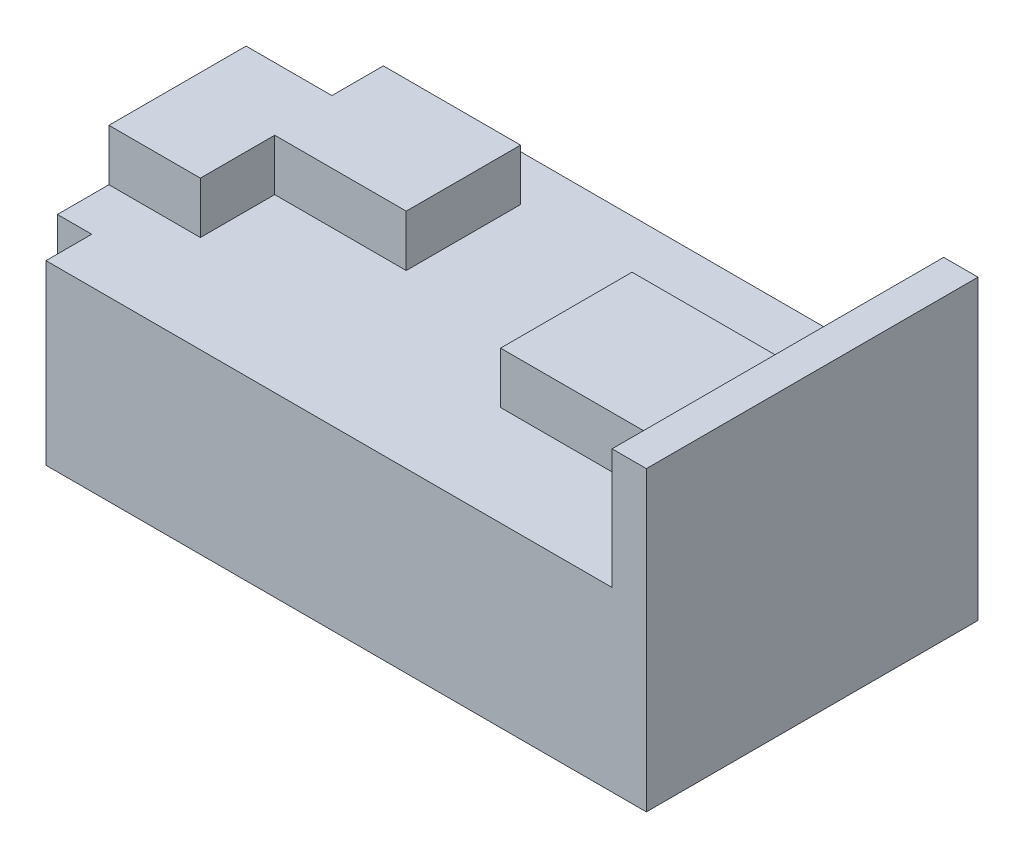
ISO-10303-21;
HEADER;
FILE_DESCRIPTION(('STEP AP214'),'2;1');
FILE_NAME('part.step','',(''),(''),'','','');
FILE_SCHEMA(('AUTOMOTIVE_DESIGN { 1 0 10303 214 1 1 1 1 }'));
ENDSEC;
DATA;
#1=APPLICATION_CONTEXT('core data for automotive mechanical design processes');
#2=APPLICATION_PROTOCOL_DEFINITION('international standard','automotive_design',2000,#1);
#3=PRODUCT_CONTEXT('',#1,'mechanical');
#4=PRODUCT('Part','Part','',(#3));
#5=PRODUCT_RELATED_PRODUCT_CATEGORY('part','',(#4));
#6=PRODUCT_DEFINITION_FORMATION('','',#4);
#7=PRODUCT_DEFINITION_CONTEXT('part definition',#1,'design');
#8=PRODUCT_DEFINITION('design','',#6,#7);
#9=PRODUCT_DEFINITION_SHAPE('','',#8);
#10=(LENGTH_UNIT() NAMED_UNIT(*) SI_UNIT(.MILLI.,.METRE.));
#11=(NAMED_UNIT(*) PLANE_ANGLE_UNIT() SI_UNIT($,.RADIAN.));
#12=(NAMED_UNIT(*) SI_UNIT($,.STERADIAN.) SOLID_ANGLE_UNIT());
#13=UNCERTAINTY_MEASURE_WITH_UNIT(LENGTH_MEASURE(1.E-05),#10,'distance_accuracy_value','');
#14=(GEOMETRIC_REPRESENTATION_CONTEXT(3) GLOBAL_UNCERTAINTY_ASSIGNED_CONTEXT((#13)) GLOBAL_UNIT_ASSIGNED_CONTEXT((#10,
#11,#12)) REPRESENTATION_CONTEXT('',''));
#15=CARTESIAN_POINT('',(0.,0.,0.));
#16=DIRECTION('',(0.,0.,1.));
#17=DIRECTION('',(1.,0.,0.));
#18=AXIS2_PLACEMENT_3D('',#15,#16,#17);
#19=CARTESIAN_POINT('',(-3.,15.5,29.));
#20=DIRECTION('',(0.,-1.,0.));
#21=DIRECTION('',(1.,0.,0.));
#22=AXIS2_PLACEMENT_3D('',#19,#20,#21);
#23=PLANE('',#22);
#24=DIRECTION('',(1.,0.,0.));
#25=VECTOR('',#24,1.);
#26=CARTESIAN_POINT('',(-55.5,15.5,20.5));
#27=LINE('',#26,#25);
#28=CARTESIAN_POINT('',(-55.5,15.5,20.5));
#29=VERTEX_POINT('',#28);
#30=CARTESIAN_POINT('',(-47.5,15.5,20.5));
#31=VERTEX_POINT('',#30);
#32=EDGE_CURVE('E350',#29,#31,#27,.T.);
#33=ORIENTED_EDGE('',*,*,#32,.F.);
#34=DIRECTION('',(0.,0.,-1.));
#35=VECTOR('',#34,1.);
#36=CARTESIAN_POINT('',(-55.5,15.5,29.));
#37=LINE('',#36,#35);
#38=CARTESIAN_POINT('',(-55.5,15.5,25.));
#39=VERTEX_POINT('',#38);
#40=EDGE_CURVE('E204',#39,#29,#37,.T.);
#41=ORIENTED_EDGE('',*,*,#40,.F.);
#42=DIRECTION('',(-1.,0.,0.));
#43=VECTOR('',#42,1.);
#44=CARTESIAN_POINT('',(-55.5,15.5,25.));
#45=LINE('',#44,#43);
#46=CARTESIAN_POINT('',(-52.5,15.5,25.));
#47=VERTEX_POINT('',#46);
#48=EDGE_CURVE('E264',#47,#39,#45,.T.);
#49=ORIENTED_EDGE('',*,*,#48,.F.);
#50=DIRECTION('',(0.,0.,-1.));
#51=VECTOR('',#50,1.);
#52=CARTESIAN_POINT('',(-52.5,15.5,29.));
#53=LINE('',#52,#51);
#54=CARTESIAN_POINT('',(-52.5,15.5,29.));
#55=VERTEX_POINT('',#54);
#56=EDGE_CURVE('E238',#55,#47,#53,.T.);
#57=ORIENTED_EDGE('',*,*,#56,.F.);
#58=DIRECTION('',(-1.,0.,0.));
#59=VECTOR('',#58,1.);
#60=CARTESIAN_POINT('',(-3.,15.5,29.));
#61=LINE('',#60,#59);
#62=CARTESIAN_POINT('',(-3.,15.5,29.));
#63=VERTEX_POINT('',#62);
#64=EDGE_CURVE('E278',#63,#55,#61,.T.);
#65=ORIENTED_EDGE('',*,*,#64,.F.);
#66=DIRECTION('',(0.,0.,-1.));
#67=VECTOR('',#66,1.);
#68=CARTESIAN_POINT('',(-3.,15.5,29.));
#69=LINE('',#68,#67);
#70=CARTESIAN_POINT('',(-3.,15.5,20.25));
#71=VERTEX_POINT('',#70);
#72=EDGE_CURVE('E11',#63,#71,#69,.T.);
#73=ORIENTED_EDGE('',*,*,#72,.T.);
#74=DIRECTION('',(1.,0.,0.));
#75=VECTOR('',#74,1.);
#76=CARTESIAN_POINT('',(-21.5,15.5,20.25));
#77=LINE('',#76,#75);
#78=CARTESIAN_POINT('',(-21.5,15.5,20.25));
#79=VERTEX_POINT('',#78);
#80=EDGE_CURVE('E208',#79,#71,#77,.T.);
#81=ORIENTED_EDGE('',*,*,#80,.F.);
#82=DIRECTION('',(0.,0.,1.));
#83=VECTOR('',#82,1.);
#84=CARTESIAN_POINT('',(-21.5,15.5,20.25));
#85=LINE('',#84,#83);
#86=CARTESIAN_POINT('',(-21.5,15.5,8.75));
#87=VERTEX_POINT('',#86);
#88=EDGE_CURVE('E205',#87,#79,#85,.T.);
#89=ORIENTED_EDGE('',*,*,#88,.F.);
#90=DIRECTION('',(-1.,0.,0.));
#91=VECTOR('',#90,1.);
#92=CARTESIAN_POINT('',(-21.5,15.5,8.75));
#93=LINE('',#92,#91);
#94=CARTESIAN_POINT('',(-3.,15.5,8.75000000000001));
#95=VERTEX_POINT('',#94);
#96=EDGE_CURVE('E218',#95,#87,#93,.T.);
#97=ORIENTED_EDGE('',*,*,#96,.F.);
#98=CARTESIAN_POINT('',(-3.,15.5,0.));
#99=VERTEX_POINT('',#98);
#100=EDGE_CURVE('E40',#95,#99,#69,.T.);
#101=ORIENTED_EDGE('',*,*,#100,.T.);
#102=DIRECTION('',(-1.,0.,0.));
#103=VECTOR('',#102,1.);
#104=CARTESIAN_POINT('',(-3.,15.5,0.));
#105=LINE('',#104,#103);
#106=CARTESIAN_POINT('',(-52.5,15.5,0.));
#107=VERTEX_POINT('',#106);
#108=EDGE_CURVE('E291',#99,#107,#105,.T.);
#109=ORIENTED_EDGE('',*,*,#108,.T.);
#110=DIRECTION('',(0.,0.,-1.));
#111=VECTOR('',#110,1.);
#112=CARTESIAN_POINT('',(-52.5,15.5,0.));
#113=LINE('',#112,#111);
#114=CARTESIAN_POINT('',(-52.5,15.5,4.));
#115=VERTEX_POINT('',#114);
#116=EDGE_CURVE('E243',#115,#107,#113,.T.);
#117=ORIENTED_EDGE('',*,*,#116,.F.);
#118=DIRECTION('',(1.,0.,0.));
#119=VECTOR('',#118,1.);
#120=CARTESIAN_POINT('',(-55.5,15.5,4.));
#121=LINE('',#120,#119);
#122=CARTESIAN_POINT('',(-55.5,15.5,4.));
#123=VERTEX_POINT('',#122);
#124=EDGE_CURVE('E247',#123,#115,#121,.T.);
#125=ORIENTED_EDGE('',*,*,#124,.F.);
#126=CARTESIAN_POINT('',(-55.5,15.5,8.50000000000001));
#127=VERTEX_POINT('',#126);
#128=EDGE_CURVE('E309',#127,#123,#37,.T.);
#129=ORIENTED_EDGE('',*,*,#128,.F.);
#130=DIRECTION('',(-1.,0.,0.));
#131=VECTOR('',#130,1.);
#132=CARTESIAN_POINT('',(-55.5,15.5,8.5));
#133=LINE('',#132,#131);
#134=CARTESIAN_POINT('',(-48.,15.5,8.5));
#135=VERTEX_POINT('',#134);
#136=EDGE_CURVE('E198',#135,#127,#133,.T.);
#137=ORIENTED_EDGE('',*,*,#136,.F.);
#138=DIRECTION('',(0.,0.,1.));
#139=VECTOR('',#138,1.);
#140=CARTESIAN_POINT('',(-48.,15.5,8.5));
#141=LINE('',#140,#139);
#142=CARTESIAN_POINT('',(-48.,15.5,4.));
#143=VERTEX_POINT('',#142);
#144=EDGE_CURVE('E364',#143,#135,#141,.T.);
#145=ORIENTED_EDGE('',*,*,#144,.F.);
#146=DIRECTION('',(-1.,0.,0.));
#147=VECTOR('',#146,1.);
#148=CARTESIAN_POINT('',(-48.,15.5,4.));
#149=LINE('',#148,#147);
#150=CARTESIAN_POINT('',(-36.,15.5,4.));
#151=VERTEX_POINT('',#150);
#152=EDGE_CURVE('E362',#151,#143,#149,.T.);
#153=ORIENTED_EDGE('',*,*,#152,.F.);
#154=DIRECTION('',(0.,0.,-1.));
#155=VECTOR('',#154,1.);
#156=CARTESIAN_POINT('',(-36.,15.5,14.));
#157=LINE('',#156,#155);
#158=CARTESIAN_POINT('',(-36.,15.5,14.));
#159=VERTEX_POINT('',#158);
#160=EDGE_CURVE('E360',#159,#151,#157,.T.);
#161=ORIENTED_EDGE('',*,*,#160,.F.);
#162=DIRECTION('',(1.,0.,0.));
#163=VECTOR('',#162,1.);
#164=CARTESIAN_POINT('',(-47.5,15.5,14.));
#165=LINE('',#164,#163);
#166=CARTESIAN_POINT('',(-47.5,15.5,14.));
#167=VERTEX_POINT('',#166);
#168=EDGE_CURVE('E354',#167,#159,#165,.T.);
#169=ORIENTED_EDGE('',*,*,#168,.F.);
#170=DIRECTION('',(0.,0.,-1.));
#171=VECTOR('',#170,1.);
#172=CARTESIAN_POINT('',(-47.5,15.5,20.5));
#173=LINE('',#172,#171);
#174=EDGE_CURVE('E352',#31,#167,#173,.T.);
#175=ORIENTED_EDGE('',*,*,#174,.F.);
#176=EDGE_LOOP('',(#33,#41,#49,#57,#65,#73,#81,#89,#97,#101,#109,#117,#125,#129,#137,#145,#153,
#161,#169,#175));
#177=FACE_BOUND('',#176,.T.);
#178=ADVANCED_FACE('F32',(#177),#23,.F.);
#179=CARTESIAN_POINT('',(-3.,26.,29.));
#180=DIRECTION('',(1.,0.,0.));
#181=DIRECTION('',(0.,1.,0.));
#182=AXIS2_PLACEMENT_3D('',#179,#180,#181);
#183=PLANE('',#182);
#184=DIRECTION('',(0.,-1.,0.));
#185=VECTOR('',#184,1.);
#186=CARTESIAN_POINT('',(-3.,20.,20.25));
#187=LINE('',#186,#185);
#188=CARTESIAN_POINT('',(-3.,20.,20.25));
#189=VERTEX_POINT('',#188);
#190=EDGE_CURVE('E233',#189,#71,#187,.T.);
#191=ORIENTED_EDGE('',*,*,#190,.T.);
#192=ORIENTED_EDGE('',*,*,#72,.F.);
#193=DIRECTION('',(0.,-1.,0.));
#194=VECTOR('',#193,1.);
#195=CARTESIAN_POINT('',(-3.,26.,29.));
#196=LINE('',#195,#194);
#197=CARTESIAN_POINT('',(-3.,26.,29.));
#198=VERTEX_POINT('',#197);
#199=EDGE_CURVE('E275',#198,#63,#196,.T.);
#200=ORIENTED_EDGE('',*,*,#199,.F.);
#201=DIRECTION('',(0.,0.,-1.));
#202=VECTOR('',#201,1.);
#203=CARTESIAN_POINT('',(-3.,26.,29.));
#204=LINE('',#203,#202);
#205=CARTESIAN_POINT('',(-3.,26.,0.));
#206=VERTEX_POINT('',#205);
#207=EDGE_CURVE('E288',#198,#206,#204,.T.);
#208=ORIENTED_EDGE('',*,*,#207,.T.);
#209=DIRECTION('',(0.,-1.,0.));
#210=VECTOR('',#209,1.);
#211=CARTESIAN_POINT('',(-3.,26.,0.));
#212=LINE('',#211,#210);
#213=EDGE_CURVE('E255',#206,#99,#212,.T.);
#214=ORIENTED_EDGE('',*,*,#213,.T.);
#215=ORIENTED_EDGE('',*,*,#100,.F.);
#216=DIRECTION('',(0.,-1.,0.));
#217=VECTOR('',#216,1.);
#218=CARTESIAN_POINT('',(-3.,20.,8.75));
#219=LINE('',#218,#217);
#220=CARTESIAN_POINT('',(-3.,20.,8.75));
#221=VERTEX_POINT('',#220);
#222=EDGE_CURVE('E55',#221,#95,#219,.T.);
#223=ORIENTED_EDGE('',*,*,#222,.F.);
#224=DIRECTION('',(0.,0.,-1.));
#225=VECTOR('',#224,1.);
#226=CARTESIAN_POINT('',(-3.,20.,20.25));
#227=LINE('',#226,#225);
#228=EDGE_CURVE('E221',#189,#221,#227,.T.);
#229=ORIENTED_EDGE('',*,*,#228,.F.);
#230=EDGE_LOOP('',(#191,#192,#200,#208,#214,#215,#223,#229));
#231=FACE_BOUND('',#230,.T.);
#232=ADVANCED_FACE('F34',(#231),#183,.F.);
#233=CARTESIAN_POINT('',(-55.5,15.5,29.));
#234=DIRECTION('',(1.,0.,0.));
#235=DIRECTION('',(0.,0.,-1.));
#236=AXIS2_PLACEMENT_3D('',#233,#234,#235);
#237=PLANE('',#236);
#238=ORIENTED_EDGE('',*,*,#40,.T.);
#239=DIRECTION('',(0.,-1.,0.));
#240=VECTOR('',#239,1.);
#241=CARTESIAN_POINT('',(-55.5,20.,20.5));
#242=LINE('',#241,#240);
#243=CARTESIAN_POINT('',(-55.5,20.,20.5));
#244=VERTEX_POINT('',#243);
#245=EDGE_CURVE('E186',#244,#29,#242,.T.);
#246=ORIENTED_EDGE('',*,*,#245,.F.);
#247=DIRECTION('',(0.,0.,1.));
#248=VECTOR('',#247,1.);
#249=CARTESIAN_POINT('',(-55.5,20.,20.5));
#250=LINE('',#249,#248);
#251=CARTESIAN_POINT('',(-55.5,20.,8.5));
#252=VERTEX_POINT('',#251);
#253=EDGE_CURVE('E193',#252,#244,#250,.T.);
#254=ORIENTED_EDGE('',*,*,#253,.F.);
#255=DIRECTION('',(0.,-1.,0.));
#256=VECTOR('',#255,1.);
#257=CARTESIAN_POINT('',(-55.5,20.,8.5));
#258=LINE('',#257,#256);
#259=EDGE_CURVE('E47',#252,#127,#258,.T.);
#260=ORIENTED_EDGE('',*,*,#259,.T.);
#261=ORIENTED_EDGE('',*,*,#128,.T.);
#262=DIRECTION('',(0.,1.,0.));
#263=VECTOR('',#262,1.);
#264=CARTESIAN_POINT('',(-55.5,0.,4.));
#265=LINE('',#264,#263);
#266=CARTESIAN_POINT('',(-55.5,0.,4.));
#267=VERTEX_POINT('',#266);
#268=EDGE_CURVE('E246',#267,#123,#265,.T.);
#269=ORIENTED_EDGE('',*,*,#268,.F.);
#270=DIRECTION('',(0.,0.,-1.));
#271=VECTOR('',#270,1.);
#272=CARTESIAN_POINT('',(-55.5,0.,29.));
#273=LINE('',#272,#271);
#274=CARTESIAN_POINT('',(-55.5,0.,25.));
#275=VERTEX_POINT('',#274);
#276=EDGE_CURVE('E307',#275,#267,#273,.T.);
#277=ORIENTED_EDGE('',*,*,#276,.F.);
#278=DIRECTION('',(0.,1.,0.));
#279=VECTOR('',#278,1.);
#280=CARTESIAN_POINT('',(-55.5,0.,25.));
#281=LINE('',#280,#279);
#282=EDGE_CURVE('E250',#275,#39,#281,.T.);
#283=ORIENTED_EDGE('',*,*,#282,.T.);
#284=EDGE_LOOP('',(#238,#246,#254,#260,#261,#269,#277,#283));
#285=FACE_BOUND('',#284,.T.);
#286=ADVANCED_FACE('F201',(#285),#237,.F.);
#287=CARTESIAN_POINT('',(-55.5,0.,29.));
#288=DIRECTION('',(0.,1.,0.));
#289=DIRECTION('',(0.,0.,1.));
#290=AXIS2_PLACEMENT_3D('',#287,#288,#289);
#291=PLANE('',#290);
#292=DIRECTION('',(1.,0.,0.));
#293=VECTOR('',#292,1.);
#294=CARTESIAN_POINT('',(-55.5,0.,4.));
#295=LINE('',#294,#293);
#296=CARTESIAN_POINT('',(-52.5,0.,4.));
#297=VERTEX_POINT('',#296);
#298=EDGE_CURVE('E239',#267,#297,#295,.T.);
#299=ORIENTED_EDGE('',*,*,#298,.T.);
#300=DIRECTION('',(0.,0.,-1.));
#301=VECTOR('',#300,1.);
#302=CARTESIAN_POINT('',(-52.5,0.,0.));
#303=LINE('',#302,#301);
#304=CARTESIAN_POINT('',(-52.5,0.,0.));
#305=VERTEX_POINT('',#304);
#306=EDGE_CURVE('E242',#297,#305,#303,.T.);
#307=ORIENTED_EDGE('',*,*,#306,.T.);
#308=DIRECTION('',(1.,0.,0.));
#309=VECTOR('',#308,1.);
#310=CARTESIAN_POINT('',(-55.5,0.,0.));
#311=LINE('',#310,#309);
#312=CARTESIAN_POINT('',(0.,0.,0.));
#313=VERTEX_POINT('',#312);
#314=EDGE_CURVE('E294',#305,#313,#311,.T.);
#315=ORIENTED_EDGE('',*,*,#314,.T.);
#316=DIRECTION('',(0.,0.,-1.));
#317=VECTOR('',#316,1.);
#318=CARTESIAN_POINT('',(0.,0.,29.));
#319=LINE('',#318,#317);
#320=CARTESIAN_POINT('',(0.,0.,29.));
#321=VERTEX_POINT('',#320);
#322=EDGE_CURVE('E304',#321,#313,#319,.T.);
#323=ORIENTED_EDGE('',*,*,#322,.F.);
#324=DIRECTION('',(1.,0.,0.));
#325=VECTOR('',#324,1.);
#326=CARTESIAN_POINT('',(-55.5,0.,29.));
#327=LINE('',#326,#325);
#328=CARTESIAN_POINT('',(-52.5,0.,29.));
#329=VERTEX_POINT('',#328);
#330=EDGE_CURVE('E282',#329,#321,#327,.T.);
#331=ORIENTED_EDGE('',*,*,#330,.F.);
#332=DIRECTION('',(0.,0.,-1.));
#333=VECTOR('',#332,1.);
#334=CARTESIAN_POINT('',(-52.5,0.,29.));
#335=LINE('',#334,#333);
#336=CARTESIAN_POINT('',(-52.5,0.,25.));
#337=VERTEX_POINT('',#336);
#338=EDGE_CURVE('E260',#329,#337,#335,.T.);
#339=ORIENTED_EDGE('',*,*,#338,.T.);
#340=DIRECTION('',(-1.,0.,0.));
#341=VECTOR('',#340,1.);
#342=CARTESIAN_POINT('',(-55.5,0.,25.));
#343=LINE('',#342,#341);
#344=EDGE_CURVE('E263',#337,#275,#343,.T.);
#345=ORIENTED_EDGE('',*,*,#344,.T.);
#346=ORIENTED_EDGE('',*,*,#276,.T.);
#347=EDGE_LOOP('',(#299,#307,#315,#323,#331,#339,#345,#346));
#348=FACE_BOUND('',#347,.T.);
#349=ADVANCED_FACE('F331',(#348),#291,.F.);
#350=CARTESIAN_POINT('',(0.,0.,29.));
#351=DIRECTION('',(-1.,0.,0.));
#352=DIRECTION('',(0.,0.,1.));
#353=AXIS2_PLACEMENT_3D('',#350,#351,#352);
#354=PLANE('',#353);
#355=DIRECTION('',(0.,1.,0.));
#356=VECTOR('',#355,1.);
#357=CARTESIAN_POINT('',(0.,0.,0.));
#358=LINE('',#357,#356);
#359=CARTESIAN_POINT('',(0.,26.,0.));
#360=VERTEX_POINT('',#359);
#361=EDGE_CURVE('E296',#313,#360,#358,.T.);
#362=ORIENTED_EDGE('',*,*,#361,.T.);
#363=DIRECTION('',(0.,0.,-1.));
#364=VECTOR('',#363,1.);
#365=CARTESIAN_POINT('',(0.,26.,29.));
#366=LINE('',#365,#364);
#367=CARTESIAN_POINT('',(0.,26.,29.));
#368=VERTEX_POINT('',#367);
#369=EDGE_CURVE('E301',#368,#360,#366,.T.);
#370=ORIENTED_EDGE('',*,*,#369,.F.);
#371=DIRECTION('',(0.,1.,0.));
#372=VECTOR('',#371,1.);
#373=CARTESIAN_POINT('',(0.,0.,29.));
#374=LINE('',#373,#372);
#375=EDGE_CURVE('E284',#321,#368,#374,.T.);
#376=ORIENTED_EDGE('',*,*,#375,.F.);
#377=ORIENTED_EDGE('',*,*,#322,.T.);
#378=EDGE_LOOP('',(#362,#370,#376,#377));
#379=FACE_BOUND('',#378,.T.);
#380=ADVANCED_FACE('F335',(#379),#354,.F.);
#381=CARTESIAN_POINT('',(0.,26.,29.));
#382=DIRECTION('',(0.,-1.,0.));
#383=DIRECTION('',(0.,0.,-1.));
#384=AXIS2_PLACEMENT_3D('',#381,#382,#383);
#385=PLANE('',#384);
#386=DIRECTION('',(-1.,0.,0.));
#387=VECTOR('',#386,1.);
#388=CARTESIAN_POINT('',(0.,26.,0.));
#389=LINE('',#388,#387);
#390=EDGE_CURVE('E279',#360,#206,#389,.T.);
#391=ORIENTED_EDGE('',*,*,#390,.T.);
#392=ORIENTED_EDGE('',*,*,#207,.F.);
#393=DIRECTION('',(-1.,0.,0.));
#394=VECTOR('',#393,1.);
#395=CARTESIAN_POINT('',(0.,26.,29.));
#396=LINE('',#395,#394);
#397=EDGE_CURVE('E286',#368,#198,#396,.T.);
#398=ORIENTED_EDGE('',*,*,#397,.F.);
#399=ORIENTED_EDGE('',*,*,#369,.T.);
#400=EDGE_LOOP('',(#391,#392,#398,#399));
#401=FACE_BOUND('',#400,.T.);
#402=ADVANCED_FACE('F427',(#401),#385,.F.);
#403=CARTESIAN_POINT('',(0.,0.,29.));
#404=DIRECTION('',(0.,0.,-1.));
#405=DIRECTION('',(-1.,0.,0.));
#406=AXIS2_PLACEMENT_3D('',#403,#404,#405);
#407=PLANE('',#406);
#408=ORIENTED_EDGE('',*,*,#64,.T.);
#409=DIRECTION('',(0.,1.,0.));
#410=VECTOR('',#409,1.);
#411=CARTESIAN_POINT('',(-52.5,0.,29.));
#412=LINE('',#411,#410);
#413=EDGE_CURVE('E267',#329,#55,#412,.T.);
#414=ORIENTED_EDGE('',*,*,#413,.F.);
#415=ORIENTED_EDGE('',*,*,#330,.T.);
#416=ORIENTED_EDGE('',*,*,#375,.T.);
#417=ORIENTED_EDGE('',*,*,#397,.T.);
#418=ORIENTED_EDGE('',*,*,#199,.T.);
#419=EDGE_LOOP('',(#408,#414,#415,#416,#417,#418));
#420=FACE_BOUND('',#419,.T.);
#421=ADVANCED_FACE('F339',(#420),#407,.F.);
#422=CARTESIAN_POINT('',(0.,0.,0.));
#423=DIRECTION('',(0.,0.,-1.));
#424=DIRECTION('',(-1.,0.,0.));
#425=AXIS2_PLACEMENT_3D('',#422,#423,#424);
#426=PLANE('',#425);
#427=DIRECTION('',(0.,1.,0.));
#428=VECTOR('',#427,1.);
#429=CARTESIAN_POINT('',(-52.5,0.,0.));
#430=LINE('',#429,#428);
#431=EDGE_CURVE('E252',#305,#107,#430,.T.);
#432=ORIENTED_EDGE('',*,*,#431,.T.);
#433=ORIENTED_EDGE('',*,*,#108,.F.);
#434=ORIENTED_EDGE('',*,*,#213,.F.);
#435=ORIENTED_EDGE('',*,*,#390,.F.);
#436=ORIENTED_EDGE('',*,*,#361,.F.);
#437=ORIENTED_EDGE('',*,*,#314,.F.);
#438=EDGE_LOOP('',(#432,#433,#434,#435,#436,#437));
#439=FACE_BOUND('',#438,.T.);
#440=ADVANCED_FACE('F325',(#439),#426,.T.);
#441=CARTESIAN_POINT('',(-52.5,0.,0.));
#442=DIRECTION('',(1.,0.,0.));
#443=DIRECTION('',(0.,1.,0.));
#444=AXIS2_PLACEMENT_3D('',#441,#442,#443);
#445=PLANE('',#444);
#446=ORIENTED_EDGE('',*,*,#116,.T.);
#447=ORIENTED_EDGE('',*,*,#431,.F.);
#448=ORIENTED_EDGE('',*,*,#306,.F.);
#449=DIRECTION('',(0.,1.,0.));
#450=VECTOR('',#449,1.);
#451=CARTESIAN_POINT('',(-52.5,0.,4.));
#452=LINE('',#451,#450);
#453=EDGE_CURVE('E256',#297,#115,#452,.T.);
#454=ORIENTED_EDGE('',*,*,#453,.T.);
#455=EDGE_LOOP('',(#446,#447,#448,#454));
#456=FACE_BOUND('',#455,.T.);
#457=ADVANCED_FACE('F321',(#456),#445,.F.);
#458=CARTESIAN_POINT('',(-55.5,0.,4.));
#459=DIRECTION('',(0.,0.,1.));
#460=DIRECTION('',(1.,0.,0.));
#461=AXIS2_PLACEMENT_3D('',#458,#459,#460);
#462=PLANE('',#461);
#463=ORIENTED_EDGE('',*,*,#124,.T.);
#464=ORIENTED_EDGE('',*,*,#453,.F.);
#465=ORIENTED_EDGE('',*,*,#298,.F.);
#466=ORIENTED_EDGE('',*,*,#268,.T.);
#467=EDGE_LOOP('',(#463,#464,#465,#466));
#468=FACE_BOUND('',#467,.T.);
#469=ADVANCED_FACE('F317',(#468),#462,.F.);
#470=CARTESIAN_POINT('',(-55.5,0.,25.));
#471=DIRECTION('',(0.,0.,-1.));
#472=DIRECTION('',(-1.,0.,0.));
#473=AXIS2_PLACEMENT_3D('',#470,#471,#472);
#474=PLANE('',#473);
#475=ORIENTED_EDGE('',*,*,#48,.T.);
#476=ORIENTED_EDGE('',*,*,#282,.F.);
#477=ORIENTED_EDGE('',*,*,#344,.F.);
#478=DIRECTION('',(0.,1.,0.));
#479=VECTOR('',#478,1.);
#480=CARTESIAN_POINT('',(-52.5,0.,25.));
#481=LINE('',#480,#479);
#482=EDGE_CURVE('E272',#337,#47,#481,.T.);
#483=ORIENTED_EDGE('',*,*,#482,.T.);
#484=EDGE_LOOP('',(#475,#476,#477,#483));
#485=FACE_BOUND('',#484,.T.);
#486=ADVANCED_FACE('F348',(#485),#474,.F.);
#487=CARTESIAN_POINT('',(-52.5,0.,29.));
#488=DIRECTION('',(1.,0.,0.));
#489=DIRECTION('',(0.,1.,0.));
#490=AXIS2_PLACEMENT_3D('',#487,#488,#489);
#491=PLANE('',#490);
#492=ORIENTED_EDGE('',*,*,#56,.T.);
#493=ORIENTED_EDGE('',*,*,#482,.F.);
#494=ORIENTED_EDGE('',*,*,#338,.F.);
#495=ORIENTED_EDGE('',*,*,#413,.T.);
#496=EDGE_LOOP('',(#492,#493,#494,#495));
#497=FACE_BOUND('',#496,.T.);
#498=ADVANCED_FACE('F344',(#497),#491,.F.);
#499=CARTESIAN_POINT('',(-21.5,20.,20.25));
#500=DIRECTION('',(1.,0.,0.));
#501=DIRECTION('',(0.,1.,0.));
#502=AXIS2_PLACEMENT_3D('',#499,#500,#501);
#503=PLANE('',#502);
#504=ORIENTED_EDGE('',*,*,#88,.T.);
#505=DIRECTION('',(0.,-1.,0.));
#506=VECTOR('',#505,1.);
#507=CARTESIAN_POINT('',(-21.5,20.,20.25));
#508=LINE('',#507,#506);
#509=CARTESIAN_POINT('',(-21.5,20.,20.25));
#510=VERTEX_POINT('',#509);
#511=EDGE_CURVE('E235',#510,#79,#508,.T.);
#512=ORIENTED_EDGE('',*,*,#511,.F.);
#513=DIRECTION('',(0.,0.,1.));
#514=VECTOR('',#513,1.);
#515=CARTESIAN_POINT('',(-21.5,20.,20.25));
#516=LINE('',#515,#514);
#517=CARTESIAN_POINT('',(-21.5,20.,8.75));
#518=VERTEX_POINT('',#517);
#519=EDGE_CURVE('E214',#518,#510,#516,.T.);
#520=ORIENTED_EDGE('',*,*,#519,.F.);
#521=DIRECTION('',(0.,-1.,0.));
#522=VECTOR('',#521,1.);
#523=CARTESIAN_POINT('',(-21.5,20.,8.75));
#524=LINE('',#523,#522);
#525=EDGE_CURVE('E224',#518,#87,#524,.T.);
#526=ORIENTED_EDGE('',*,*,#525,.T.);
#527=EDGE_LOOP('',(#504,#512,#520,#526));
#528=FACE_BOUND('',#527,.T.);
#529=ADVANCED_FACE('F437',(#528),#503,.F.);
#530=CARTESIAN_POINT('',(-21.5,20.,20.25));
#531=DIRECTION('',(0.,0.,-1.));
#532=DIRECTION('',(-1.,0.,0.));
#533=AXIS2_PLACEMENT_3D('',#530,#531,#532);
#534=PLANE('',#533);
#535=ORIENTED_EDGE('',*,*,#80,.T.);
#536=ORIENTED_EDGE('',*,*,#190,.F.);
#537=DIRECTION('',(1.,0.,0.));
#538=VECTOR('',#537,1.);
#539=CARTESIAN_POINT('',(-21.5,20.,20.25));
#540=LINE('',#539,#538);
#541=EDGE_CURVE('E217',#510,#189,#540,.T.);
#542=ORIENTED_EDGE('',*,*,#541,.F.);
#543=ORIENTED_EDGE('',*,*,#511,.T.);
#544=EDGE_LOOP('',(#535,#536,#542,#543));
#545=FACE_BOUND('',#544,.T.);
#546=ADVANCED_FACE('F446',(#545),#534,.F.);
#547=CARTESIAN_POINT('',(-21.5,20.,8.75));
#548=DIRECTION('',(0.,0.,1.));
#549=DIRECTION('',(1.,0.,0.));
#550=AXIS2_PLACEMENT_3D('',#547,#548,#549);
#551=PLANE('',#550);
#552=ORIENTED_EDGE('',*,*,#96,.T.);
#553=ORIENTED_EDGE('',*,*,#525,.F.);
#554=DIRECTION('',(-1.,0.,0.));
#555=VECTOR('',#554,1.);
#556=CARTESIAN_POINT('',(-21.5,20.,8.75));
#557=LINE('',#556,#555);
#558=EDGE_CURVE('E223',#221,#518,#557,.T.);
#559=ORIENTED_EDGE('',*,*,#558,.F.);
#560=ORIENTED_EDGE('',*,*,#222,.T.);
#561=EDGE_LOOP('',(#552,#553,#559,#560));
#562=FACE_BOUND('',#561,.T.);
#563=ADVANCED_FACE('F450',(#562),#551,.F.);
#564=CARTESIAN_POINT('',(0.,20.,0.));
#565=DIRECTION('',(0.,-1.,0.));
#566=DIRECTION('',(1.,0.,0.));
#567=AXIS2_PLACEMENT_3D('',#564,#565,#566);
#568=PLANE('',#567);
#569=ORIENTED_EDGE('',*,*,#519,.T.);
#570=ORIENTED_EDGE('',*,*,#541,.T.);
#571=ORIENTED_EDGE('',*,*,#228,.T.);
#572=ORIENTED_EDGE('',*,*,#558,.T.);
#573=EDGE_LOOP('',(#569,#570,#571,#572));
#574=FACE_BOUND('',#573,.T.);
#575=ADVANCED_FACE('F414',(#574),#568,.F.);
#576=CARTESIAN_POINT('',(-55.5,20.,20.5));
#577=DIRECTION('',(0.,0.,-1.));
#578=DIRECTION('',(-1.,0.,0.));
#579=AXIS2_PLACEMENT_3D('',#576,#577,#578);
#580=PLANE('',#579);
#581=ORIENTED_EDGE('',*,*,#32,.T.);
#582=DIRECTION('',(0.,-1.,0.));
#583=VECTOR('',#582,1.);
#584=CARTESIAN_POINT('',(-47.5,20.,20.5));
#585=LINE('',#584,#583);
#586=CARTESIAN_POINT('',(-47.5,20.,20.5));
#587=VERTEX_POINT('',#586);
#588=EDGE_CURVE('E189',#587,#31,#585,.T.);
#589=ORIENTED_EDGE('',*,*,#588,.F.);
#590=DIRECTION('',(1.,0.,0.));
#591=VECTOR('',#590,1.);
#592=CARTESIAN_POINT('',(-55.5,20.,20.5));
#593=LINE('',#592,#591);
#594=EDGE_CURVE('E182',#244,#587,#593,.T.);
#595=ORIENTED_EDGE('',*,*,#594,.F.);
#596=ORIENTED_EDGE('',*,*,#245,.T.);
#597=EDGE_LOOP('',(#581,#589,#595,#596));
#598=FACE_BOUND('',#597,.T.);
#599=ADVANCED_FACE('F184',(#598),#580,.F.);
#600=CARTESIAN_POINT('',(-47.5,20.,20.5));
#601=DIRECTION('',(-1.,0.,0.));
#602=DIRECTION('',(0.,-1.,0.));
#603=AXIS2_PLACEMENT_3D('',#600,#601,#602);
#604=PLANE('',#603);
#605=ORIENTED_EDGE('',*,*,#174,.T.);
#606=DIRECTION('',(0.,-1.,0.));
#607=VECTOR('',#606,1.);
#608=CARTESIAN_POINT('',(-47.5,20.,14.));
#609=LINE('',#608,#607);
#610=CARTESIAN_POINT('',(-47.5,20.,14.));
#611=VERTEX_POINT('',#610);
#612=EDGE_CURVE('E210',#611,#167,#609,.T.);
#613=ORIENTED_EDGE('',*,*,#612,.F.);
#614=DIRECTION('',(0.,0.,-1.));
#615=VECTOR('',#614,1.);
#616=CARTESIAN_POINT('',(-47.5,20.,20.5));
#617=LINE('',#616,#615);
#618=EDGE_CURVE('E192',#587,#611,#617,.T.);
#619=ORIENTED_EDGE('',*,*,#618,.F.);
#620=ORIENTED_EDGE('',*,*,#588,.T.);
#621=EDGE_LOOP('',(#605,#613,#619,#620));
#622=FACE_BOUND('',#621,.T.);
#623=ADVANCED_FACE('F406',(#622),#604,.F.);
#624=CARTESIAN_POINT('',(-47.5,20.,14.));
#625=DIRECTION('',(0.,0.,-1.));
#626=DIRECTION('',(-1.,0.,0.));
#627=AXIS2_PLACEMENT_3D('',#624,#625,#626);
#628=PLANE('',#627);
#629=ORIENTED_EDGE('',*,*,#168,.T.);
#630=DIRECTION('',(0.,-1.,0.));
#631=VECTOR('',#630,1.);
#632=CARTESIAN_POINT('',(-36.,20.,14.));
#633=LINE('',#632,#631);
#634=CARTESIAN_POINT('',(-36.,20.,14.));
#635=VERTEX_POINT('',#634);
#636=EDGE_CURVE('E377',#635,#159,#633,.T.);
#637=ORIENTED_EDGE('',*,*,#636,.F.);
#638=DIRECTION('',(1.,0.,0.));
#639=VECTOR('',#638,1.);
#640=CARTESIAN_POINT('',(-47.5,20.,14.));
#641=LINE('',#640,#639);
#642=EDGE_CURVE('E385',#611,#635,#641,.T.);
#643=ORIENTED_EDGE('',*,*,#642,.F.);
#644=ORIENTED_EDGE('',*,*,#612,.T.);
#645=EDGE_LOOP('',(#629,#637,#643,#644));
#646=FACE_BOUND('',#645,.T.);
#647=ADVANCED_FACE('F383',(#646),#628,.F.);
#648=CARTESIAN_POINT('',(-36.,20.,14.));
#649=DIRECTION('',(-1.,0.,0.));
#650=DIRECTION('',(0.,-1.,0.));
#651=AXIS2_PLACEMENT_3D('',#648,#649,#650);
#652=PLANE('',#651);
#653=ORIENTED_EDGE('',*,*,#160,.T.);
#654=DIRECTION('',(0.,-1.,0.));
#655=VECTOR('',#654,1.);
#656=CARTESIAN_POINT('',(-36.,20.,4.));
#657=LINE('',#656,#655);
#658=CARTESIAN_POINT('',(-36.,20.,4.));
#659=VERTEX_POINT('',#658);
#660=EDGE_CURVE('E374',#659,#151,#657,.T.);
#661=ORIENTED_EDGE('',*,*,#660,.F.);
#662=DIRECTION('',(0.,0.,-1.));
#663=VECTOR('',#662,1.);
#664=CARTESIAN_POINT('',(-36.,20.,14.));
#665=LINE('',#664,#663);
#666=EDGE_CURVE('E401',#635,#659,#665,.T.);
#667=ORIENTED_EDGE('',*,*,#666,.F.);
#668=ORIENTED_EDGE('',*,*,#636,.T.);
#669=EDGE_LOOP('',(#653,#661,#667,#668));
#670=FACE_BOUND('',#669,.T.);
#671=ADVANCED_FACE('F392',(#670),#652,.F.);
#672=CARTESIAN_POINT('',(-48.,20.,4.));
#673=DIRECTION('',(0.,0.,1.));
#674=DIRECTION('',(1.,0.,0.));
#675=AXIS2_PLACEMENT_3D('',#672,#673,#674);
#676=PLANE('',#675);
#677=ORIENTED_EDGE('',*,*,#152,.T.);
#678=DIRECTION('',(0.,-1.,0.));
#679=VECTOR('',#678,1.);
#680=CARTESIAN_POINT('',(-48.,20.,4.));
#681=LINE('',#680,#679);
#682=CARTESIAN_POINT('',(-48.,20.,4.));
#683=VERTEX_POINT('',#682);
#684=EDGE_CURVE('E371',#683,#143,#681,.T.);
#685=ORIENTED_EDGE('',*,*,#684,.F.);
#686=DIRECTION('',(-1.,0.,0.));
#687=VECTOR('',#686,1.);
#688=CARTESIAN_POINT('',(-48.,20.,4.));
#689=LINE('',#688,#687);
#690=EDGE_CURVE('E398',#659,#683,#689,.T.);
#691=ORIENTED_EDGE('',*,*,#690,.F.);
#692=ORIENTED_EDGE('',*,*,#660,.T.);
#693=EDGE_LOOP('',(#677,#685,#691,#692));
#694=FACE_BOUND('',#693,.T.);
#695=ADVANCED_FACE('F396',(#694),#676,.F.);
#696=CARTESIAN_POINT('',(-48.,20.,8.5));
#697=DIRECTION('',(1.,0.,0.));
#698=DIRECTION('',(0.,1.,0.));
#699=AXIS2_PLACEMENT_3D('',#696,#697,#698);
#700=PLANE('',#699);
#701=ORIENTED_EDGE('',*,*,#144,.T.);
#702=DIRECTION('',(0.,-1.,0.));
#703=VECTOR('',#702,1.);
#704=CARTESIAN_POINT('',(-48.,20.,8.5));
#705=LINE('',#704,#703);
#706=CARTESIAN_POINT('',(-48.,20.,8.5));
#707=VERTEX_POINT('',#706);
#708=EDGE_CURVE('E368',#707,#135,#705,.T.);
#709=ORIENTED_EDGE('',*,*,#708,.F.);
#710=DIRECTION('',(0.,0.,1.));
#711=VECTOR('',#710,1.);
#712=CARTESIAN_POINT('',(-48.,20.,8.5));
#713=LINE('',#712,#711);
#714=EDGE_CURVE('E400',#683,#707,#713,.T.);
#715=ORIENTED_EDGE('',*,*,#714,.F.);
#716=ORIENTED_EDGE('',*,*,#684,.T.);
#717=EDGE_LOOP('',(#701,#709,#715,#716));
#718=FACE_BOUND('',#717,.T.);
#719=ADVANCED_FACE('F499',(#718),#700,.F.);
#720=CARTESIAN_POINT('',(-55.5,20.,8.5));
#721=DIRECTION('',(0.,0.,1.));
#722=DIRECTION('',(1.,0.,0.));
#723=AXIS2_PLACEMENT_3D('',#720,#721,#722);
#724=PLANE('',#723);
#725=ORIENTED_EDGE('',*,*,#136,.T.);
#726=ORIENTED_EDGE('',*,*,#259,.F.);
#727=DIRECTION('',(-1.,0.,0.));
#728=VECTOR('',#727,1.);
#729=CARTESIAN_POINT('',(-55.5,20.,8.5));
#730=LINE('',#729,#728);
#731=EDGE_CURVE('E197',#707,#252,#730,.T.);
#732=ORIENTED_EDGE('',*,*,#731,.F.);
#733=ORIENTED_EDGE('',*,*,#708,.T.);
#734=EDGE_LOOP('',(#725,#726,#732,#733));
#735=FACE_BOUND('',#734,.T.);
#736=ADVANCED_FACE('F508',(#735),#724,.F.);
#737=CARTESIAN_POINT('',(0.,20.,0.));
#738=DIRECTION('',(0.,-1.,0.));
#739=DIRECTION('',(0.,0.,-1.));
#740=AXIS2_PLACEMENT_3D('',#737,#738,#739);
#741=PLANE('',#740);
#742=ORIENTED_EDGE('',*,*,#253,.T.);
#743=ORIENTED_EDGE('',*,*,#594,.T.);
#744=ORIENTED_EDGE('',*,*,#618,.T.);
#745=ORIENTED_EDGE('',*,*,#642,.T.);
#746=ORIENTED_EDGE('',*,*,#666,.T.);
#747=ORIENTED_EDGE('',*,*,#690,.T.);
#748=ORIENTED_EDGE('',*,*,#714,.T.);
#749=ORIENTED_EDGE('',*,*,#731,.T.);
#750=EDGE_LOOP('',(#742,#743,#744,#745,#746,#747,#748,#749));
#751=FACE_BOUND('',#750,.T.);
#752=ADVANCED_FACE('F195',(#751),#741,.F.);
#753=CLOSED_SHELL('',(#178,#232,#286,#349,#380,#402,#421,#440,#457,#469,#486,#498,#529,#546,
#563,#575,#599,#623,#647,#671,#695,#719,#736,#752));
#754=MANIFOLD_SOLID_BREP('B2',#753);
#755=ADVANCED_BREP_SHAPE_REPRESENTATION('',(#18,#754),#14);
#756=SHAPE_DEFINITION_REPRESENTATION(#9,#755);
ENDSEC;
END-ISO-10303-21;
